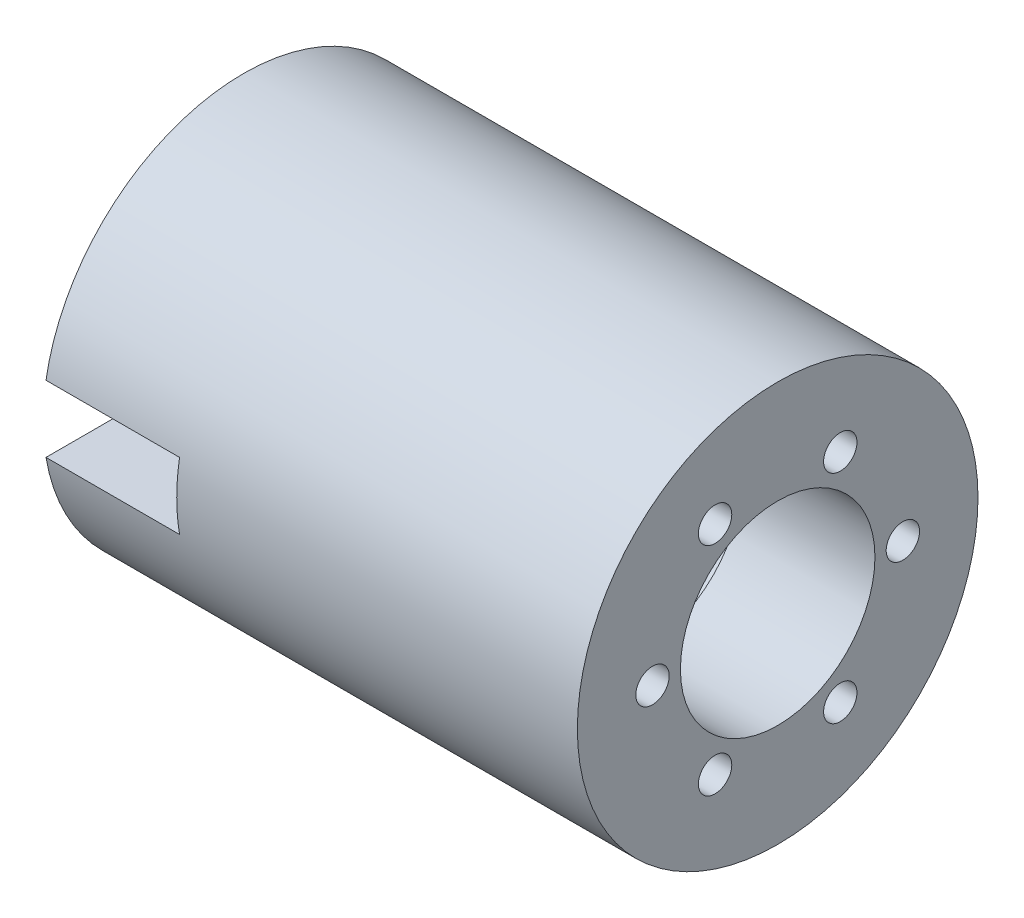
ISO-10303-21;
HEADER;
FILE_DESCRIPTION(('STEP AP214'),'2;1');
FILE_NAME('part.step','',(''),(''),'','','');
FILE_SCHEMA(('AUTOMOTIVE_DESIGN { 1 0 10303 214 1 1 1 1 }'));
ENDSEC;
DATA;
#1=APPLICATION_CONTEXT('core data for automotive mechanical design processes');
#2=APPLICATION_PROTOCOL_DEFINITION('international standard','automotive_design',2000,#1);
#3=PRODUCT_CONTEXT('',#1,'mechanical');
#4=PRODUCT('Part','Part','',(#3));
#5=PRODUCT_RELATED_PRODUCT_CATEGORY('part','',(#4));
#6=PRODUCT_DEFINITION_FORMATION('','',#4);
#7=PRODUCT_DEFINITION_CONTEXT('part definition',#1,'design');
#8=PRODUCT_DEFINITION('design','',#6,#7);
#9=PRODUCT_DEFINITION_SHAPE('','',#8);
#10=(LENGTH_UNIT() NAMED_UNIT(*) SI_UNIT(.MILLI.,.METRE.));
#11=(NAMED_UNIT(*) PLANE_ANGLE_UNIT() SI_UNIT($,.RADIAN.));
#12=(NAMED_UNIT(*) SI_UNIT($,.STERADIAN.) SOLID_ANGLE_UNIT());
#13=UNCERTAINTY_MEASURE_WITH_UNIT(LENGTH_MEASURE(1.E-05),#10,'distance_accuracy_value','');
#14=(GEOMETRIC_REPRESENTATION_CONTEXT(3) GLOBAL_UNCERTAINTY_ASSIGNED_CONTEXT((#13)) GLOBAL_UNIT_ASSIGNED_CONTEXT((#10,
#11,#12)) REPRESENTATION_CONTEXT('',''));
#15=CARTESIAN_POINT('',(0.,0.,0.));
#16=DIRECTION('',(0.,0.,1.));
#17=DIRECTION('',(1.,0.,0.));
#18=AXIS2_PLACEMENT_3D('',#15,#16,#17);
#19=CARTESIAN_POINT('',(-50.8,0.,0.));
#20=DIRECTION('',(-1.,0.,0.));
#21=DIRECTION('',(0.,0.,1.));
#22=AXIS2_PLACEMENT_3D('',#19,#20,#21);
#23=CYLINDRICAL_SURFACE('',#22,38.1);
#24=CARTESIAN_POINT('',(50.8,0.,0.));
#25=DIRECTION('',(-1.,0.,0.));
#26=DIRECTION('',(0.,0.,1.));
#27=AXIS2_PLACEMENT_3D('',#24,#25,#26);
#28=CIRCLE('',#27,38.1);
#29=CARTESIAN_POINT('',(50.8,0.,38.1));
#30=VERTEX_POINT('',#29);
#31=EDGE_CURVE('E596',#30,#30,#28,.T.);
#32=ORIENTED_EDGE('',*,*,#31,.T.);
#33=EDGE_LOOP('',(#32));
#34=FACE_BOUND('',#33,.T.);
#35=CARTESIAN_POINT('',(-50.8,0.,0.));
#36=DIRECTION('',(-1.,0.,0.));
#37=DIRECTION('',(0.,0.,1.));
#38=AXIS2_PLACEMENT_3D('',#35,#36,#37);
#39=CIRCLE('',#38,38.1);
#40=CARTESIAN_POINT('',(-50.8,6.35,37.5671066226826));
#41=VERTEX_POINT('',#40);
#42=CARTESIAN_POINT('',(-50.8,-6.35,37.5671066226826));
#43=VERTEX_POINT('',#42);
#44=EDGE_CURVE('E548',#41,#43,#39,.T.);
#45=ORIENTED_EDGE('',*,*,#44,.F.);
#46=DIRECTION('',(-1.,0.,0.));
#47=VECTOR('',#46,1.);
#48=CARTESIAN_POINT('',(-50.8,6.35,37.5671066226826));
#49=LINE('',#48,#47);
#50=CARTESIAN_POINT('',(-25.4,6.35,37.5671066226826));
#51=VERTEX_POINT('',#50);
#52=EDGE_CURVE('E541',#41,#51,#49,.F.);
#53=ORIENTED_EDGE('',*,*,#52,.T.);
#54=CARTESIAN_POINT('',(-25.4,0.,0.));
#55=DIRECTION('',(-1.,0.,0.));
#56=DIRECTION('',(0.,-1.,0.));
#57=AXIS2_PLACEMENT_3D('',#54,#55,#56);
#58=CIRCLE('',#57,38.1);
#59=CARTESIAN_POINT('',(-25.4,-6.34999999999998,37.5671066226826));
#60=VERTEX_POINT('',#59);
#61=EDGE_CURVE('E528',#51,#60,#58,.F.);
#62=ORIENTED_EDGE('',*,*,#61,.T.);
#63=DIRECTION('',(-1.,0.,0.));
#64=VECTOR('',#63,1.);
#65=CARTESIAN_POINT('',(-50.8,-6.35,37.5671066226826));
#66=LINE('',#65,#64);
#67=EDGE_CURVE('E536',#60,#43,#66,.T.);
#68=ORIENTED_EDGE('',*,*,#67,.T.);
#69=EDGE_LOOP('',(#45,#53,#62,#68));
#70=FACE_BOUND('',#69,.T.);
#71=ADVANCED_FACE('F455',(#34,#70),#23,.T.);
#72=CARTESIAN_POINT('',(-50.8,0.,0.));
#73=DIRECTION('',(-1.,0.,0.));
#74=DIRECTION('',(0.,0.,1.));
#75=AXIS2_PLACEMENT_3D('',#72,#73,#74);
#76=PLANE('',#75);
#77=CARTESIAN_POINT('',(-50.8,0.,0.));
#78=DIRECTION('',(-1.,0.,0.));
#79=DIRECTION('',(0.,0.,1.));
#80=AXIS2_PLACEMENT_3D('',#77,#78,#79);
#81=CIRCLE('',#80,21.2725);
#82=CARTESIAN_POINT('',(-50.8,6.35,20.3026292940102));
#83=VERTEX_POINT('',#82);
#84=CARTESIAN_POINT('',(-50.8,-6.35,20.3026292940102));
#85=VERTEX_POINT('',#84);
#86=EDGE_CURVE('E606',#83,#85,#81,.T.);
#87=ORIENTED_EDGE('',*,*,#86,.F.);
#88=DIRECTION('',(0.,0.,-1.));
#89=VECTOR('',#88,1.);
#90=CARTESIAN_POINT('',(-50.8,6.35,38.1));
#91=LINE('',#90,#89);
#92=EDGE_CURVE('E537',#41,#83,#91,.T.);
#93=ORIENTED_EDGE('',*,*,#92,.F.);
#94=ORIENTED_EDGE('',*,*,#44,.T.);
#95=DIRECTION('',(0.,0.,-1.));
#96=VECTOR('',#95,1.);
#97=CARTESIAN_POINT('',(-50.8,-6.35,38.1));
#98=LINE('',#97,#96);
#99=EDGE_CURVE('E616',#43,#85,#98,.T.);
#100=ORIENTED_EDGE('',*,*,#99,.T.);
#101=EDGE_LOOP('',(#87,#93,#94,#100));
#102=FACE_BOUND('',#101,.T.);
#103=ADVANCED_FACE('F620',(#102),#76,.T.);
#104=CARTESIAN_POINT('',(-50.8,0.,0.));
#105=DIRECTION('',(-1.,0.,0.));
#106=DIRECTION('',(0.,0.,1.));
#107=AXIS2_PLACEMENT_3D('',#104,#105,#106);
#108=CYLINDRICAL_SURFACE('',#107,21.2725);
#109=CARTESIAN_POINT('',(25.4,0.,0.));
#110=DIRECTION('',(-1.,0.,0.));
#111=DIRECTION('',(0.,0.,1.));
#112=AXIS2_PLACEMENT_3D('',#109,#110,#111);
#113=CIRCLE('',#112,21.2725);
#114=CARTESIAN_POINT('',(25.4,17.4570729607871,12.1560626804799));
#115=VERTEX_POINT('',#114);
#116=CARTESIAN_POINT('',(25.4,19.2559955716851,9.04023731952017));
#117=VERTEX_POINT('',#116);
#118=EDGE_CURVE('E603',#115,#117,#113,.T.);
#119=ORIENTED_EDGE('',*,*,#118,.F.);
#120=CARTESIAN_POINT('',(25.4,1.79892261089789,21.1963));
#121=VERTEX_POINT('',#120);
#122=EDGE_CURVE('E602',#121,#115,#113,.T.);
#123=ORIENTED_EDGE('',*,*,#122,.F.);
#124=CARTESIAN_POINT('',(25.4,-1.79892261089803,21.1963));
#125=VERTEX_POINT('',#124);
#126=EDGE_CURVE('E847',#125,#121,#113,.T.);
#127=ORIENTED_EDGE('',*,*,#126,.F.);
#128=CARTESIAN_POINT('',(25.4,-17.4570729607872,12.1560626804798));
#129=VERTEX_POINT('',#128);
#130=EDGE_CURVE('E851',#129,#125,#113,.T.);
#131=ORIENTED_EDGE('',*,*,#130,.F.);
#132=CARTESIAN_POINT('',(25.4,-19.2559955716851,9.04023731952018));
#133=VERTEX_POINT('',#132);
#134=EDGE_CURVE('E884',#133,#129,#113,.T.);
#135=ORIENTED_EDGE('',*,*,#134,.F.);
#136=CARTESIAN_POINT('',(25.4,-19.2559955716851,-9.04023731952019));
#137=VERTEX_POINT('',#136);
#138=EDGE_CURVE('E881',#137,#133,#113,.T.);
#139=ORIENTED_EDGE('',*,*,#138,.F.);
#140=CARTESIAN_POINT('',(25.4,-17.4570729607871,-12.1560626804798));
#141=VERTEX_POINT('',#140);
#142=EDGE_CURVE('E878',#141,#137,#113,.T.);
#143=ORIENTED_EDGE('',*,*,#142,.F.);
#144=CARTESIAN_POINT('',(25.4,-1.79892261089791,-21.1963));
#145=VERTEX_POINT('',#144);
#146=EDGE_CURVE('E875',#145,#141,#113,.T.);
#147=ORIENTED_EDGE('',*,*,#146,.F.);
#148=CARTESIAN_POINT('',(25.4,1.79892261089791,-21.1963));
#149=VERTEX_POINT('',#148);
#150=EDGE_CURVE('E873',#149,#145,#113,.T.);
#151=ORIENTED_EDGE('',*,*,#150,.F.);
#152=CARTESIAN_POINT('',(25.4,17.4570729607871,-12.15606268048));
#153=VERTEX_POINT('',#152);
#154=EDGE_CURVE('E872',#153,#149,#113,.T.);
#155=ORIENTED_EDGE('',*,*,#154,.F.);
#156=CARTESIAN_POINT('',(25.4,19.2559955716851,-9.04023731952007));
#157=VERTEX_POINT('',#156);
#158=EDGE_CURVE('E870',#157,#153,#113,.T.);
#159=ORIENTED_EDGE('',*,*,#158,.F.);
#160=EDGE_CURVE('E607',#117,#157,#113,.T.);
#161=ORIENTED_EDGE('',*,*,#160,.F.);
#162=EDGE_LOOP('',(#119,#123,#127,#131,#135,#139,#143,#147,#151,#155,#159,#161));
#163=FACE_BOUND('',#162,.T.);
#164=DIRECTION('',(-1.,0.,0.));
#165=VECTOR('',#164,1.);
#166=CARTESIAN_POINT('',(-50.8,6.35,20.3026292940102));
#167=LINE('',#166,#165);
#168=CARTESIAN_POINT('',(-25.4,6.35,20.3026292940102));
#169=VERTEX_POINT('',#168);
#170=EDGE_CURVE('E12',#83,#169,#167,.F.);
#171=ORIENTED_EDGE('',*,*,#170,.F.);
#172=ORIENTED_EDGE('',*,*,#86,.T.);
#173=DIRECTION('',(-1.,0.,0.));
#174=VECTOR('',#173,1.);
#175=CARTESIAN_POINT('',(-50.8,-6.35,20.3026292940102));
#176=LINE('',#175,#174);
#177=CARTESIAN_POINT('',(-25.4,-6.34999999999998,20.3026292940102));
#178=VERTEX_POINT('',#177);
#179=EDGE_CURVE('E462',#178,#85,#176,.T.);
#180=ORIENTED_EDGE('',*,*,#179,.F.);
#181=CARTESIAN_POINT('',(-25.4,0.,0.));
#182=DIRECTION('',(-1.,0.,0.));
#183=DIRECTION('',(0.,-1.,0.));
#184=AXIS2_PLACEMENT_3D('',#181,#182,#183);
#185=CIRCLE('',#184,21.2725);
#186=EDGE_CURVE('E611',#169,#178,#185,.F.);
#187=ORIENTED_EDGE('',*,*,#186,.F.);
#188=EDGE_LOOP('',(#171,#172,#180,#187));
#189=FACE_BOUND('',#188,.T.);
#190=ADVANCED_FACE('F622',(#163,#189),#108,.F.);
#191=CARTESIAN_POINT('',(25.4,0.,0.));
#192=DIRECTION('',(1.,0.,0.));
#193=DIRECTION('',(0.,0.,-1.));
#194=AXIS2_PLACEMENT_3D('',#191,#192,#193);
#195=PLANE('',#194);
#196=CARTESIAN_POINT('',(25.4,0.,0.));
#197=DIRECTION('',(1.,0.,0.));
#198=DIRECTION('',(0.,0.,-1.));
#199=AXIS2_PLACEMENT_3D('',#196,#197,#198);
#200=CIRCLE('',#199,18.5);
#201=CARTESIAN_POINT('',(25.4,0.,-18.5));
#202=VERTEX_POINT('',#201);
#203=EDGE_CURVE('E557',#202,#202,#200,.T.);
#204=ORIENTED_EDGE('',*,*,#203,.T.);
#205=EDGE_LOOP('',(#204));
#206=FACE_BOUND('',#205,.T.);
#207=ORIENTED_EDGE('',*,*,#130,.T.);
#208=CARTESIAN_POINT('',(25.4,0.,23.8125));
#209=DIRECTION('',(1.,0.,0.));
#210=DIRECTION('',(0.,0.86602540378444,-0.499999999999998));
#211=AXIS2_PLACEMENT_3D('',#208,#209,#210);
#212=CIRCLE('',#211,3.17499999999997);
#213=EDGE_CURVE('E555',#125,#121,#212,.T.);
#214=ORIENTED_EDGE('',*,*,#213,.T.);
#215=ORIENTED_EDGE('',*,*,#122,.T.);
#216=CARTESIAN_POINT('',(25.4,20.6222299276169,11.90625));
#217=DIRECTION('',(1.,0.,0.));
#218=DIRECTION('',(0.,0.,-1.));
#219=AXIS2_PLACEMENT_3D('',#216,#217,#218);
#220=CIRCLE('',#219,3.17499999999997);
#221=EDGE_CURVE('E590',#115,#117,#220,.T.);
#222=ORIENTED_EDGE('',*,*,#221,.T.);
#223=ORIENTED_EDGE('',*,*,#160,.T.);
#224=CARTESIAN_POINT('',(25.4,20.6222299276169,-11.90625));
#225=DIRECTION('',(1.,0.,0.));
#226=DIRECTION('',(0.,0.,-1.));
#227=AXIS2_PLACEMENT_3D('',#224,#225,#226);
#228=CIRCLE('',#227,3.17500000000002);
#229=EDGE_CURVE('E583',#157,#153,#228,.T.);
#230=ORIENTED_EDGE('',*,*,#229,.T.);
#231=ORIENTED_EDGE('',*,*,#154,.T.);
#232=CARTESIAN_POINT('',(25.4,0.,-23.8125));
#233=DIRECTION('',(1.,0.,0.));
#234=DIRECTION('',(0.,0.,-1.));
#235=AXIS2_PLACEMENT_3D('',#232,#233,#234);
#236=CIRCLE('',#235,3.17499999999997);
#237=EDGE_CURVE('E576',#149,#145,#236,.T.);
#238=ORIENTED_EDGE('',*,*,#237,.T.);
#239=ORIENTED_EDGE('',*,*,#146,.T.);
#240=CARTESIAN_POINT('',(25.4,-20.6222299276169,-11.90625));
#241=DIRECTION('',(1.,0.,0.));
#242=DIRECTION('',(0.,0.,-1.));
#243=AXIS2_PLACEMENT_3D('',#240,#241,#242);
#244=CIRCLE('',#243,3.17499999999997);
#245=EDGE_CURVE('E569',#141,#137,#244,.T.);
#246=ORIENTED_EDGE('',*,*,#245,.T.);
#247=ORIENTED_EDGE('',*,*,#138,.T.);
#248=CARTESIAN_POINT('',(25.4,-20.6222299276169,11.90625));
#249=DIRECTION('',(1.,0.,0.));
#250=DIRECTION('',(0.,0.,-1.));
#251=AXIS2_PLACEMENT_3D('',#248,#249,#250);
#252=CIRCLE('',#251,3.17499999999997);
#253=EDGE_CURVE('E593',#133,#129,#252,.T.);
#254=ORIENTED_EDGE('',*,*,#253,.T.);
#255=EDGE_LOOP('',(#207,#214,#215,#222,#223,#230,#231,#238,#239,#246,#247,#254));
#256=FACE_BOUND('',#255,.T.);
#257=ADVANCED_FACE('F624',(#206,#256),#195,.F.);
#258=CARTESIAN_POINT('',(50.8,0.,0.));
#259=DIRECTION('',(1.,0.,0.));
#260=DIRECTION('',(0.,0.,-1.));
#261=AXIS2_PLACEMENT_3D('',#258,#259,#260);
#262=PLANE('',#261);
#263=CARTESIAN_POINT('',(50.8,0.,23.8125));
#264=DIRECTION('',(1.,0.,0.));
#265=DIRECTION('',(0.,0.86602540378444,-0.499999999999998));
#266=AXIS2_PLACEMENT_3D('',#263,#264,#265);
#267=CIRCLE('',#266,3.17499999999997);
#268=CARTESIAN_POINT('',(50.8,2.7496306570155,22.225));
#269=VERTEX_POINT('',#268);
#270=EDGE_CURVE('E549',#269,#269,#267,.T.);
#271=ORIENTED_EDGE('',*,*,#270,.F.);
#272=EDGE_LOOP('',(#271));
#273=FACE_BOUND('',#272,.T.);
#274=CARTESIAN_POINT('',(50.8,-20.6222299276169,-11.90625));
#275=DIRECTION('',(1.,0.,0.));
#276=DIRECTION('',(0.,0.,-1.));
#277=AXIS2_PLACEMENT_3D('',#274,#275,#276);
#278=CIRCLE('',#277,3.17499999999997);
#279=CARTESIAN_POINT('',(50.8,-20.6222299276169,-15.08125));
#280=VERTEX_POINT('',#279);
#281=EDGE_CURVE('E565',#280,#280,#278,.T.);
#282=ORIENTED_EDGE('',*,*,#281,.F.);
#283=EDGE_LOOP('',(#282));
#284=FACE_BOUND('',#283,.T.);
#285=CARTESIAN_POINT('',(50.8,0.,-23.8125));
#286=DIRECTION('',(1.,0.,0.));
#287=DIRECTION('',(0.,0.,-1.));
#288=AXIS2_PLACEMENT_3D('',#285,#286,#287);
#289=CIRCLE('',#288,3.17499999999997);
#290=CARTESIAN_POINT('',(50.8,0.,-26.9875));
#291=VERTEX_POINT('',#290);
#292=EDGE_CURVE('E573',#291,#291,#289,.T.);
#293=ORIENTED_EDGE('',*,*,#292,.F.);
#294=EDGE_LOOP('',(#293));
#295=FACE_BOUND('',#294,.T.);
#296=CARTESIAN_POINT('',(50.8,20.6222299276169,-11.90625));
#297=DIRECTION('',(1.,0.,0.));
#298=DIRECTION('',(0.,0.,-1.));
#299=AXIS2_PLACEMENT_3D('',#296,#297,#298);
#300=CIRCLE('',#299,3.17500000000002);
#301=CARTESIAN_POINT('',(50.8,20.6222299276169,-15.08125));
#302=VERTEX_POINT('',#301);
#303=EDGE_CURVE('E580',#302,#302,#300,.T.);
#304=ORIENTED_EDGE('',*,*,#303,.F.);
#305=EDGE_LOOP('',(#304));
#306=FACE_BOUND('',#305,.T.);
#307=CARTESIAN_POINT('',(50.8,20.6222299276169,11.90625));
#308=DIRECTION('',(1.,0.,0.));
#309=DIRECTION('',(0.,0.,-1.));
#310=AXIS2_PLACEMENT_3D('',#307,#308,#309);
#311=CIRCLE('',#310,3.17499999999997);
#312=CARTESIAN_POINT('',(50.8,20.6222299276169,8.73125000000004));
#313=VERTEX_POINT('',#312);
#314=EDGE_CURVE('E587',#313,#313,#311,.T.);
#315=ORIENTED_EDGE('',*,*,#314,.F.);
#316=EDGE_LOOP('',(#315));
#317=FACE_BOUND('',#316,.T.);
#318=CARTESIAN_POINT('',(50.8,0.,0.));
#319=DIRECTION('',(1.,0.,0.));
#320=DIRECTION('',(0.,0.,-1.));
#321=AXIS2_PLACEMENT_3D('',#318,#319,#320);
#322=CIRCLE('',#321,18.5);
#323=CARTESIAN_POINT('',(50.8,0.,-18.5));
#324=VERTEX_POINT('',#323);
#325=EDGE_CURVE('E559',#324,#324,#322,.T.);
#326=ORIENTED_EDGE('',*,*,#325,.F.);
#327=EDGE_LOOP('',(#326));
#328=FACE_BOUND('',#327,.T.);
#329=CARTESIAN_POINT('',(50.8,-20.6222299276169,11.90625));
#330=DIRECTION('',(1.,0.,0.));
#331=DIRECTION('',(0.,0.,-1.));
#332=AXIS2_PLACEMENT_3D('',#329,#330,#331);
#333=CIRCLE('',#332,3.17499999999997);
#334=CARTESIAN_POINT('',(50.8,-20.6222299276169,8.73125000000004));
#335=VERTEX_POINT('',#334);
#336=EDGE_CURVE('E568',#335,#335,#333,.T.);
#337=ORIENTED_EDGE('',*,*,#336,.F.);
#338=EDGE_LOOP('',(#337));
#339=FACE_BOUND('',#338,.T.);
#340=ORIENTED_EDGE('',*,*,#31,.F.);
#341=EDGE_LOOP('',(#340));
#342=FACE_BOUND('',#341,.T.);
#343=ADVANCED_FACE('F631',(#273,#284,#295,#306,#317,#328,#339,#342),#262,.T.);
#344=CARTESIAN_POINT('',(25.4,0.,0.));
#345=DIRECTION('',(1.,0.,0.));
#346=DIRECTION('',(0.,0.,-1.));
#347=AXIS2_PLACEMENT_3D('',#344,#345,#346);
#348=PLANE('',#347);
#349=ORIENTED_EDGE('',*,*,#134,.T.);
#350=EDGE_CURVE('E597',#129,#133,#252,.T.);
#351=ORIENTED_EDGE('',*,*,#350,.T.);
#352=EDGE_LOOP('',(#349,#351));
#353=FACE_BOUND('',#352,.T.);
#354=ADVANCED_FACE('F642',(#353),#348,.T.);
#355=CARTESIAN_POINT('',(25.4,-20.6222299276169,11.90625));
#356=DIRECTION('',(1.,0.,0.));
#357=DIRECTION('',(0.,0.,-1.));
#358=AXIS2_PLACEMENT_3D('',#355,#356,#357);
#359=CYLINDRICAL_SURFACE('',#358,3.17499999999997);
#360=ORIENTED_EDGE('',*,*,#253,.F.);
#361=ORIENTED_EDGE('',*,*,#350,.F.);
#362=EDGE_LOOP('',(#360,#361));
#363=FACE_BOUND('',#362,.T.);
#364=ORIENTED_EDGE('',*,*,#336,.T.);
#365=EDGE_LOOP('',(#364));
#366=FACE_BOUND('',#365,.T.);
#367=ADVANCED_FACE('F648',(#363,#366),#359,.F.);
#368=CARTESIAN_POINT('',(25.4,0.,0.));
#369=DIRECTION('',(1.,0.,0.));
#370=DIRECTION('',(0.,0.,-1.));
#371=AXIS2_PLACEMENT_3D('',#368,#369,#370);
#372=CYLINDRICAL_SURFACE('',#371,18.5);
#373=ORIENTED_EDGE('',*,*,#203,.F.);
#374=EDGE_LOOP('',(#373));
#375=FACE_BOUND('',#374,.T.);
#376=ORIENTED_EDGE('',*,*,#325,.T.);
#377=EDGE_LOOP('',(#376));
#378=FACE_BOUND('',#377,.T.);
#379=ADVANCED_FACE('F655',(#375,#378),#372,.F.);
#380=CARTESIAN_POINT('',(25.4,0.,0.));
#381=DIRECTION('',(1.,0.,0.));
#382=DIRECTION('',(0.,0.,-1.));
#383=AXIS2_PLACEMENT_3D('',#380,#381,#382);
#384=PLANE('',#383);
#385=ORIENTED_EDGE('',*,*,#118,.T.);
#386=EDGE_CURVE('E562',#117,#115,#220,.T.);
#387=ORIENTED_EDGE('',*,*,#386,.T.);
#388=EDGE_LOOP('',(#385,#387));
#389=FACE_BOUND('',#388,.T.);
#390=ADVANCED_FACE('F658',(#389),#384,.T.);
#391=CARTESIAN_POINT('',(25.4,20.6222299276169,11.90625));
#392=DIRECTION('',(1.,0.,0.));
#393=DIRECTION('',(0.,0.,-1.));
#394=AXIS2_PLACEMENT_3D('',#391,#392,#393);
#395=CYLINDRICAL_SURFACE('',#394,3.17499999999997);
#396=ORIENTED_EDGE('',*,*,#221,.F.);
#397=ORIENTED_EDGE('',*,*,#386,.F.);
#398=EDGE_LOOP('',(#396,#397));
#399=FACE_BOUND('',#398,.T.);
#400=ORIENTED_EDGE('',*,*,#314,.T.);
#401=EDGE_LOOP('',(#400));
#402=FACE_BOUND('',#401,.T.);
#403=ADVANCED_FACE('F661',(#399,#402),#395,.F.);
#404=CARTESIAN_POINT('',(25.4,0.,0.));
#405=DIRECTION('',(1.,0.,0.));
#406=DIRECTION('',(0.,0.,-1.));
#407=AXIS2_PLACEMENT_3D('',#404,#405,#406);
#408=PLANE('',#407);
#409=ORIENTED_EDGE('',*,*,#158,.T.);
#410=EDGE_CURVE('E586',#153,#157,#228,.T.);
#411=ORIENTED_EDGE('',*,*,#410,.T.);
#412=EDGE_LOOP('',(#409,#411));
#413=FACE_BOUND('',#412,.T.);
#414=ADVANCED_FACE('F665',(#413),#408,.T.);
#415=CARTESIAN_POINT('',(25.4,20.6222299276169,-11.90625));
#416=DIRECTION('',(1.,0.,0.));
#417=DIRECTION('',(0.,0.,-1.));
#418=AXIS2_PLACEMENT_3D('',#415,#416,#417);
#419=CYLINDRICAL_SURFACE('',#418,3.17500000000002);
#420=ORIENTED_EDGE('',*,*,#229,.F.);
#421=ORIENTED_EDGE('',*,*,#410,.F.);
#422=EDGE_LOOP('',(#420,#421));
#423=FACE_BOUND('',#422,.T.);
#424=ORIENTED_EDGE('',*,*,#303,.T.);
#425=EDGE_LOOP('',(#424));
#426=FACE_BOUND('',#425,.T.);
#427=ADVANCED_FACE('F669',(#423,#426),#419,.F.);
#428=CARTESIAN_POINT('',(25.4,0.,0.));
#429=DIRECTION('',(1.,0.,0.));
#430=DIRECTION('',(0.,0.,-1.));
#431=AXIS2_PLACEMENT_3D('',#428,#429,#430);
#432=PLANE('',#431);
#433=ORIENTED_EDGE('',*,*,#150,.T.);
#434=EDGE_CURVE('E579',#145,#149,#236,.T.);
#435=ORIENTED_EDGE('',*,*,#434,.T.);
#436=EDGE_LOOP('',(#433,#435));
#437=FACE_BOUND('',#436,.T.);
#438=ADVANCED_FACE('F673',(#437),#432,.T.);
#439=CARTESIAN_POINT('',(25.4,0.,-23.8125));
#440=DIRECTION('',(1.,0.,0.));
#441=DIRECTION('',(0.,0.,-1.));
#442=AXIS2_PLACEMENT_3D('',#439,#440,#441);
#443=CYLINDRICAL_SURFACE('',#442,3.17499999999997);
#444=ORIENTED_EDGE('',*,*,#237,.F.);
#445=ORIENTED_EDGE('',*,*,#434,.F.);
#446=EDGE_LOOP('',(#444,#445));
#447=FACE_BOUND('',#446,.T.);
#448=ORIENTED_EDGE('',*,*,#292,.T.);
#449=EDGE_LOOP('',(#448));
#450=FACE_BOUND('',#449,.T.);
#451=ADVANCED_FACE('F677',(#447,#450),#443,.F.);
#452=CARTESIAN_POINT('',(25.4,0.,0.));
#453=DIRECTION('',(1.,0.,0.));
#454=DIRECTION('',(0.,0.,-1.));
#455=AXIS2_PLACEMENT_3D('',#452,#453,#454);
#456=PLANE('',#455);
#457=ORIENTED_EDGE('',*,*,#142,.T.);
#458=EDGE_CURVE('E572',#137,#141,#244,.T.);
#459=ORIENTED_EDGE('',*,*,#458,.T.);
#460=EDGE_LOOP('',(#457,#459));
#461=FACE_BOUND('',#460,.T.);
#462=ADVANCED_FACE('F681',(#461),#456,.T.);
#463=CARTESIAN_POINT('',(25.4,-20.6222299276169,-11.90625));
#464=DIRECTION('',(1.,0.,0.));
#465=DIRECTION('',(0.,0.,-1.));
#466=AXIS2_PLACEMENT_3D('',#463,#464,#465);
#467=CYLINDRICAL_SURFACE('',#466,3.17499999999997);
#468=ORIENTED_EDGE('',*,*,#245,.F.);
#469=ORIENTED_EDGE('',*,*,#458,.F.);
#470=EDGE_LOOP('',(#468,#469));
#471=FACE_BOUND('',#470,.T.);
#472=ORIENTED_EDGE('',*,*,#281,.T.);
#473=EDGE_LOOP('',(#472));
#474=FACE_BOUND('',#473,.T.);
#475=ADVANCED_FACE('F685',(#471,#474),#467,.F.);
#476=CARTESIAN_POINT('',(25.4,0.,0.));
#477=DIRECTION('',(1.,0.,0.));
#478=DIRECTION('',(0.,0.86602540378444,-0.499999999999998));
#479=AXIS2_PLACEMENT_3D('',#476,#477,#478);
#480=PLANE('',#479);
#481=ORIENTED_EDGE('',*,*,#126,.T.);
#482=EDGE_CURVE('E475',#121,#125,#212,.T.);
#483=ORIENTED_EDGE('',*,*,#482,.T.);
#484=EDGE_LOOP('',(#481,#483));
#485=FACE_BOUND('',#484,.T.);
#486=ADVANCED_FACE('F689',(#485),#480,.T.);
#487=CARTESIAN_POINT('',(25.4,0.,23.8125));
#488=DIRECTION('',(1.,0.,0.));
#489=DIRECTION('',(0.,0.,-1.));
#490=AXIS2_PLACEMENT_3D('',#487,#488,#489);
#491=CYLINDRICAL_SURFACE('',#490,3.17499999999997);
#492=ORIENTED_EDGE('',*,*,#213,.F.);
#493=ORIENTED_EDGE('',*,*,#482,.F.);
#494=EDGE_LOOP('',(#492,#493));
#495=FACE_BOUND('',#494,.T.);
#496=ORIENTED_EDGE('',*,*,#270,.T.);
#497=EDGE_LOOP('',(#496));
#498=FACE_BOUND('',#497,.T.);
#499=ADVANCED_FACE('F694',(#495,#498),#491,.F.);
#500=CARTESIAN_POINT('',(-50.8,6.35,38.1));
#501=DIRECTION('',(0.,-1.,0.));
#502=DIRECTION('',(0.,0.,-1.));
#503=AXIS2_PLACEMENT_3D('',#500,#501,#502);
#504=PLANE('',#503);
#505=ORIENTED_EDGE('',*,*,#92,.T.);
#506=ORIENTED_EDGE('',*,*,#170,.T.);
#507=DIRECTION('',(0.,0.,-1.));
#508=VECTOR('',#507,1.);
#509=CARTESIAN_POINT('',(-25.4,6.35,38.1));
#510=LINE('',#509,#508);
#511=EDGE_CURVE('E469',#51,#169,#510,.T.);
#512=ORIENTED_EDGE('',*,*,#511,.F.);
#513=ORIENTED_EDGE('',*,*,#52,.F.);
#514=EDGE_LOOP('',(#505,#506,#512,#513));
#515=FACE_BOUND('',#514,.T.);
#516=ADVANCED_FACE('F540',(#515),#504,.T.);
#517=CARTESIAN_POINT('',(-25.4,-6.34999999999998,38.1));
#518=DIRECTION('',(0.,1.,0.));
#519=DIRECTION('',(-1.,0.,0.));
#520=AXIS2_PLACEMENT_3D('',#517,#518,#519);
#521=PLANE('',#520);
#522=DIRECTION('',(0.,0.,-1.));
#523=VECTOR('',#522,1.);
#524=CARTESIAN_POINT('',(-25.4,-6.34999999999998,38.1));
#525=LINE('',#524,#523);
#526=EDGE_CURVE('E531',#60,#178,#525,.T.);
#527=ORIENTED_EDGE('',*,*,#526,.T.);
#528=ORIENTED_EDGE('',*,*,#179,.T.);
#529=ORIENTED_EDGE('',*,*,#99,.F.);
#530=ORIENTED_EDGE('',*,*,#67,.F.);
#531=EDGE_LOOP('',(#527,#528,#529,#530));
#532=FACE_BOUND('',#531,.T.);
#533=ADVANCED_FACE('F615',(#532),#521,.T.);
#534=CARTESIAN_POINT('',(-25.4,6.35,38.1));
#535=DIRECTION('',(-1.,0.,0.));
#536=DIRECTION('',(0.,-1.,0.));
#537=AXIS2_PLACEMENT_3D('',#534,#535,#536);
#538=PLANE('',#537);
#539=ORIENTED_EDGE('',*,*,#511,.T.);
#540=ORIENTED_EDGE('',*,*,#186,.T.);
#541=ORIENTED_EDGE('',*,*,#526,.F.);
#542=ORIENTED_EDGE('',*,*,#61,.F.);
#543=EDGE_LOOP('',(#539,#540,#541,#542));
#544=FACE_BOUND('',#543,.T.);
#545=ADVANCED_FACE('F529',(#544),#538,.T.);
#546=CLOSED_SHELL('',(#71,#103,#190,#257,#343,#354,#367,#379,#390,#403,#414,#427,#438,#451,#462,
#475,#486,#499,#516,#533,#545));
#547=MANIFOLD_SOLID_BREP('B2',#546);
#548=ADVANCED_BREP_SHAPE_REPRESENTATION('',(#18,#547),#14);
#549=SHAPE_DEFINITION_REPRESENTATION(#9,#548);
ENDSEC;
END-ISO-10303-21;
